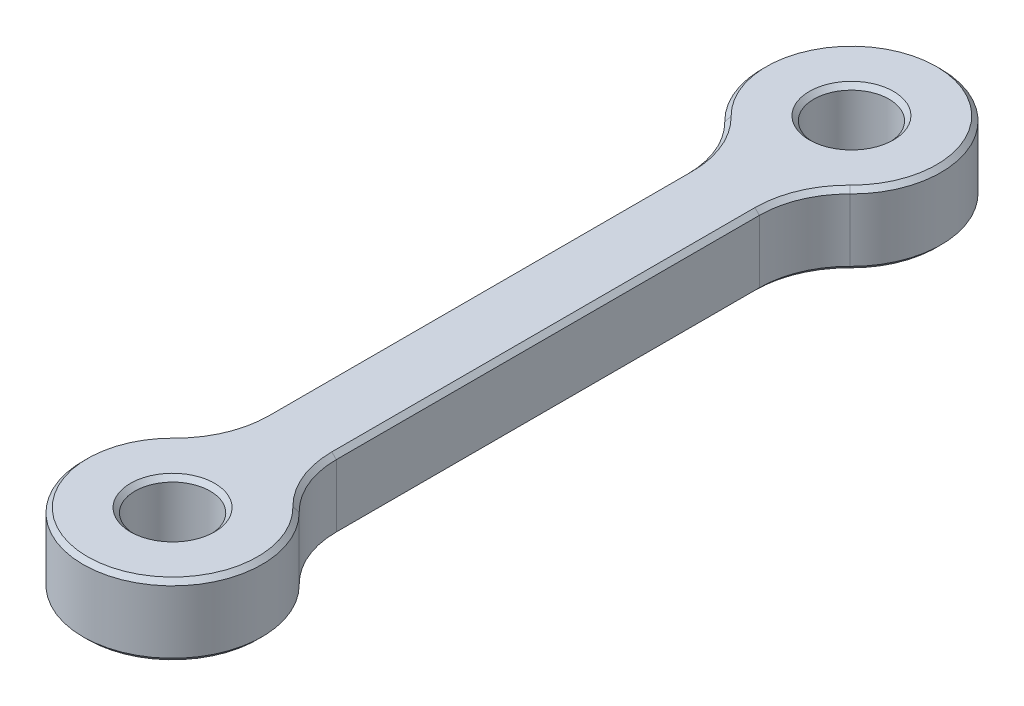
ISO-10303-21;
HEADER;
FILE_DESCRIPTION(('STEP AP214'),'2;1');
FILE_NAME('part.step','',(''),(''),'','','');
FILE_SCHEMA(('AUTOMOTIVE_DESIGN { 1 0 10303 214 1 1 1 1 }'));
ENDSEC;
DATA;
#1=APPLICATION_CONTEXT('core data for automotive mechanical design processes');
#2=APPLICATION_PROTOCOL_DEFINITION('international standard','automotive_design',2000,#1);
#3=PRODUCT_CONTEXT('',#1,'mechanical');
#4=PRODUCT('Part','Part','',(#3));
#5=PRODUCT_RELATED_PRODUCT_CATEGORY('part','',(#4));
#6=PRODUCT_DEFINITION_FORMATION('','',#4);
#7=PRODUCT_DEFINITION_CONTEXT('part definition',#1,'design');
#8=PRODUCT_DEFINITION('design','',#6,#7);
#9=PRODUCT_DEFINITION_SHAPE('','',#8);
#10=(LENGTH_UNIT() NAMED_UNIT(*) SI_UNIT(.MILLI.,.METRE.));
#11=(NAMED_UNIT(*) PLANE_ANGLE_UNIT() SI_UNIT($,.RADIAN.));
#12=(NAMED_UNIT(*) SI_UNIT($,.STERADIAN.) SOLID_ANGLE_UNIT());
#13=UNCERTAINTY_MEASURE_WITH_UNIT(LENGTH_MEASURE(1.E-05),#10,'distance_accuracy_value','');
#14=(GEOMETRIC_REPRESENTATION_CONTEXT(3) GLOBAL_UNCERTAINTY_ASSIGNED_CONTEXT((#13)) GLOBAL_UNIT_ASSIGNED_CONTEXT((#10,
#11,#12)) REPRESENTATION_CONTEXT('',''));
#15=CARTESIAN_POINT('',(0.,0.,0.));
#16=DIRECTION('',(0.,0.,1.));
#17=DIRECTION('',(1.,0.,0.));
#18=AXIS2_PLACEMENT_3D('',#15,#16,#17);
#19=CARTESIAN_POINT('',(0.,8.,-37.9));
#20=DIRECTION('',(0.,1.,0.));
#21=DIRECTION('',(0.,0.,1.));
#22=AXIS2_PLACEMENT_3D('',#19,#20,#21);
#23=PLANE('',#22);
#24=CARTESIAN_POINT('',(0.,8.,37.9));
#25=DIRECTION('',(0.,1.,0.));
#26=DIRECTION('',(0.,0.,1.));
#27=AXIS2_PLACEMENT_3D('',#24,#25,#26);
#28=CIRCLE('',#27,4.70000000000002);
#29=CARTESIAN_POINT('',(0.,8.,42.6));
#30=VERTEX_POINT('',#29);
#31=EDGE_CURVE('E11',#30,#30,#28,.F.);
#32=ORIENTED_EDGE('',*,*,#31,.T.);
#33=EDGE_LOOP('',(#32));
#34=FACE_BOUND('',#33,.T.);
#35=CARTESIAN_POINT('',(0.,8.,37.9));
#36=DIRECTION('',(0.,1.,0.));
#37=DIRECTION('',(0.,0.,1.));
#38=AXIS2_PLACEMENT_3D('',#35,#36,#37);
#39=CIRCLE('',#38,9.49999999999999);
#40=CARTESIAN_POINT('',(-6.64999999999998,8.,31.1156429928843));
#41=VERTEX_POINT('',#40);
#42=CARTESIAN_POINT('',(6.64999999999999,8.,31.1156429928843));
#43=VERTEX_POINT('',#42);
#44=EDGE_CURVE('E58',#41,#43,#39,.T.);
#45=ORIENTED_EDGE('',*,*,#44,.T.);
#46=CARTESIAN_POINT('',(14.,8.,23.6171431429143));
#47=DIRECTION('',(0.,1.,0.));
#48=DIRECTION('',(0.,0.,1.));
#49=AXIS2_PLACEMENT_3D('',#46,#47,#48);
#50=CIRCLE('',#49,10.5);
#51=CARTESIAN_POINT('',(3.49999999999998,8.,23.6171431429143));
#52=VERTEX_POINT('',#51);
#53=EDGE_CURVE('E50',#43,#52,#50,.F.);
#54=ORIENTED_EDGE('',*,*,#53,.T.);
#55=DIRECTION('',(0.,0.,-1.));
#56=VECTOR('',#55,1.);
#57=CARTESIAN_POINT('',(3.49999999999998,8.,-23.6171431429143));
#58=LINE('',#57,#56);
#59=CARTESIAN_POINT('',(3.49999999999998,8.,-23.6171431429143));
#60=VERTEX_POINT('',#59);
#61=EDGE_CURVE('E240',#52,#60,#58,.T.);
#62=ORIENTED_EDGE('',*,*,#61,.T.);
#63=CARTESIAN_POINT('',(14.,8.,-23.6171431429143));
#64=DIRECTION('',(0.,1.,0.));
#65=DIRECTION('',(0.,0.,1.));
#66=AXIS2_PLACEMENT_3D('',#63,#64,#65);
#67=CIRCLE('',#66,10.5);
#68=CARTESIAN_POINT('',(6.64999999999999,8.,-31.1156429928843));
#69=VERTEX_POINT('',#68);
#70=EDGE_CURVE('E242',#60,#69,#67,.F.);
#71=ORIENTED_EDGE('',*,*,#70,.T.);
#72=CARTESIAN_POINT('',(0.,8.,-37.9));
#73=DIRECTION('',(0.,1.,0.));
#74=DIRECTION('',(0.,0.,1.));
#75=AXIS2_PLACEMENT_3D('',#72,#73,#74);
#76=CIRCLE('',#75,9.49999999999999);
#77=CARTESIAN_POINT('',(-6.64999999999998,8.,-31.1156429928843));
#78=VERTEX_POINT('',#77);
#79=EDGE_CURVE('E244',#69,#78,#76,.T.);
#80=ORIENTED_EDGE('',*,*,#79,.T.);
#81=CARTESIAN_POINT('',(-14.,8.,-23.6171431429143));
#82=DIRECTION('',(0.,1.,0.));
#83=DIRECTION('',(0.,0.,1.));
#84=AXIS2_PLACEMENT_3D('',#81,#82,#83);
#85=CIRCLE('',#84,10.5);
#86=CARTESIAN_POINT('',(-3.49999999999998,8.,-23.6171431429143));
#87=VERTEX_POINT('',#86);
#88=EDGE_CURVE('E246',#78,#87,#85,.F.);
#89=ORIENTED_EDGE('',*,*,#88,.T.);
#90=DIRECTION('',(0.,0.,1.));
#91=VECTOR('',#90,1.);
#92=CARTESIAN_POINT('',(-3.49999999999998,8.,23.6171431429143));
#93=LINE('',#92,#91);
#94=CARTESIAN_POINT('',(-3.49999999999998,8.,23.6171431429143));
#95=VERTEX_POINT('',#94);
#96=EDGE_CURVE('E248',#87,#95,#93,.T.);
#97=ORIENTED_EDGE('',*,*,#96,.T.);
#98=CARTESIAN_POINT('',(-14.,8.,23.6171431429143));
#99=DIRECTION('',(0.,1.,0.));
#100=DIRECTION('',(0.,0.,1.));
#101=AXIS2_PLACEMENT_3D('',#98,#99,#100);
#102=CIRCLE('',#101,10.5);
#103=EDGE_CURVE('E63',#95,#41,#102,.F.);
#104=ORIENTED_EDGE('',*,*,#103,.T.);
#105=EDGE_LOOP('',(#45,#54,#62,#71,#80,#89,#97,#104));
#106=FACE_BOUND('',#105,.T.);
#107=CARTESIAN_POINT('',(0.,8.,-37.9));
#108=DIRECTION('',(0.,1.,0.));
#109=DIRECTION('',(0.,0.,1.));
#110=AXIS2_PLACEMENT_3D('',#107,#108,#109);
#111=CIRCLE('',#110,4.70000000000002);
#112=CARTESIAN_POINT('',(0.,8.,-33.2));
#113=VERTEX_POINT('',#112);
#114=EDGE_CURVE('E237',#113,#113,#111,.F.);
#115=ORIENTED_EDGE('',*,*,#114,.T.);
#116=EDGE_LOOP('',(#115));
#117=FACE_BOUND('',#116,.T.);
#118=ADVANCED_FACE('F40',(#34,#106,#117),#23,.T.);
#119=CARTESIAN_POINT('',(0.,0.,-37.9));
#120=DIRECTION('',(0.,1.,0.));
#121=DIRECTION('',(0.,0.,1.));
#122=AXIS2_PLACEMENT_3D('',#119,#120,#121);
#123=PLANE('',#122);
#124=CARTESIAN_POINT('',(0.,0.,37.9));
#125=DIRECTION('',(0.,1.,0.));
#126=DIRECTION('',(0.,0.,1.));
#127=AXIS2_PLACEMENT_3D('',#124,#125,#126);
#128=CIRCLE('',#127,4.70000000000001);
#129=CARTESIAN_POINT('',(0.,0.,42.6));
#130=VERTEX_POINT('',#129);
#131=EDGE_CURVE('E185',#130,#130,#128,.T.);
#132=ORIENTED_EDGE('',*,*,#131,.T.);
#133=EDGE_LOOP('',(#132));
#134=FACE_BOUND('',#133,.T.);
#135=CARTESIAN_POINT('',(0.,0.,-37.9));
#136=DIRECTION('',(0.,1.,0.));
#137=DIRECTION('',(0.,0.,1.));
#138=AXIS2_PLACEMENT_3D('',#135,#136,#137);
#139=CIRCLE('',#138,4.70000000000001);
#140=CARTESIAN_POINT('',(0.,0.,-33.2));
#141=VERTEX_POINT('',#140);
#142=EDGE_CURVE('E182',#141,#141,#139,.T.);
#143=ORIENTED_EDGE('',*,*,#142,.T.);
#144=EDGE_LOOP('',(#143));
#145=FACE_BOUND('',#144,.T.);
#146=DIRECTION('',(0.,0.,-1.));
#147=VECTOR('',#146,1.);
#148=CARTESIAN_POINT('',(-3.49999999999996,0.,-37.9));
#149=LINE('',#148,#147);
#150=CARTESIAN_POINT('',(-3.49999999999997,0.,23.6171431429143));
#151=VERTEX_POINT('',#150);
#152=CARTESIAN_POINT('',(-3.49999999999996,0.,-23.6171431429143));
#153=VERTEX_POINT('',#152);
#154=EDGE_CURVE('E180',#151,#153,#149,.T.);
#155=ORIENTED_EDGE('',*,*,#154,.T.);
#156=CARTESIAN_POINT('',(-14.,0.,-23.6171431429143));
#157=DIRECTION('',(0.,1.,0.));
#158=DIRECTION('',(0.,0.,1.));
#159=AXIS2_PLACEMENT_3D('',#156,#157,#158);
#160=CIRCLE('',#159,10.5);
#161=CARTESIAN_POINT('',(-6.64999999999997,0.,-31.1156429928843));
#162=VERTEX_POINT('',#161);
#163=EDGE_CURVE('E161',#153,#162,#160,.T.);
#164=ORIENTED_EDGE('',*,*,#163,.T.);
#165=CARTESIAN_POINT('',(0.,0.,-37.9));
#166=DIRECTION('',(0.,1.,0.));
#167=DIRECTION('',(0.,0.,1.));
#168=AXIS2_PLACEMENT_3D('',#165,#166,#167);
#169=CIRCLE('',#168,9.49999999999997);
#170=CARTESIAN_POINT('',(6.64999999999998,0.,-31.1156429928843));
#171=VERTEX_POINT('',#170);
#172=EDGE_CURVE('E169',#162,#171,#169,.F.);
#173=ORIENTED_EDGE('',*,*,#172,.T.);
#174=CARTESIAN_POINT('',(14.,0.,-23.6171431429143));
#175=DIRECTION('',(0.,1.,0.));
#176=DIRECTION('',(0.,0.,1.));
#177=AXIS2_PLACEMENT_3D('',#174,#175,#176);
#178=CIRCLE('',#177,10.5);
#179=CARTESIAN_POINT('',(3.49999999999997,0.,-23.6171431429143));
#180=VERTEX_POINT('',#179);
#181=EDGE_CURVE('E175',#171,#180,#178,.T.);
#182=ORIENTED_EDGE('',*,*,#181,.T.);
#183=DIRECTION('',(0.,0.,1.));
#184=VECTOR('',#183,1.);
#185=CARTESIAN_POINT('',(3.49999999999997,0.,-37.9));
#186=LINE('',#185,#184);
#187=CARTESIAN_POINT('',(3.49999999999997,0.,23.6171431429143));
#188=VERTEX_POINT('',#187);
#189=EDGE_CURVE('E328',#180,#188,#186,.T.);
#190=ORIENTED_EDGE('',*,*,#189,.T.);
#191=CARTESIAN_POINT('',(14.,0.,23.6171431429143));
#192=DIRECTION('',(0.,1.,0.));
#193=DIRECTION('',(0.,0.,1.));
#194=AXIS2_PLACEMENT_3D('',#191,#192,#193);
#195=CIRCLE('',#194,10.5);
#196=CARTESIAN_POINT('',(6.64999999999998,0.,31.1156429928843));
#197=VERTEX_POINT('',#196);
#198=EDGE_CURVE('E330',#188,#197,#195,.T.);
#199=ORIENTED_EDGE('',*,*,#198,.T.);
#200=CARTESIAN_POINT('',(0.,0.,37.9));
#201=DIRECTION('',(0.,1.,0.));
#202=DIRECTION('',(0.,0.,1.));
#203=AXIS2_PLACEMENT_3D('',#200,#201,#202);
#204=CIRCLE('',#203,9.49999999999997);
#205=CARTESIAN_POINT('',(-6.64999999999997,0.,31.1156429928843));
#206=VERTEX_POINT('',#205);
#207=EDGE_CURVE('E332',#197,#206,#204,.F.);
#208=ORIENTED_EDGE('',*,*,#207,.T.);
#209=CARTESIAN_POINT('',(-14.,0.,23.6171431429143));
#210=DIRECTION('',(0.,1.,0.));
#211=DIRECTION('',(0.,0.,1.));
#212=AXIS2_PLACEMENT_3D('',#209,#210,#211);
#213=CIRCLE('',#212,10.5);
#214=EDGE_CURVE('E187',#206,#151,#213,.T.);
#215=ORIENTED_EDGE('',*,*,#214,.T.);
#216=EDGE_LOOP('',(#155,#164,#173,#182,#190,#199,#208,#215));
#217=FACE_BOUND('',#216,.T.);
#218=ADVANCED_FACE('F178',(#134,#145,#217),#123,.F.);
#219=CARTESIAN_POINT('',(0.,8.,-37.9));
#220=DIRECTION('',(0.,-1.,0.));
#221=DIRECTION('',(0.,0.,-1.));
#222=AXIS2_PLACEMENT_3D('',#219,#220,#221);
#223=CYLINDRICAL_SURFACE('',#222,10.);
#224=DIRECTION('',(0.,-1.,0.));
#225=VECTOR('',#224,1.);
#226=CARTESIAN_POINT('',(7.,8.,-30.7585715714571));
#227=LINE('',#226,#225);
#228=CARTESIAN_POINT('',(7.,7.49999999999999,-30.7585715714571));
#229=VERTEX_POINT('',#228);
#230=CARTESIAN_POINT('',(7.,0.50000000000002,-30.7585715714571));
#231=VERTEX_POINT('',#230);
#232=EDGE_CURVE('E314',#229,#231,#227,.T.);
#233=ORIENTED_EDGE('',*,*,#232,.T.);
#234=CARTESIAN_POINT('',(0.,0.50000000000002,-37.9));
#235=DIRECTION('',(0.,1.,0.));
#236=DIRECTION('',(0.,0.,1.));
#237=AXIS2_PLACEMENT_3D('',#234,#235,#236);
#238=CIRCLE('',#237,10.);
#239=CARTESIAN_POINT('',(-6.99999999999999,0.50000000000002,-30.7585715714571));
#240=VERTEX_POINT('',#239);
#241=EDGE_CURVE('E235',#231,#240,#238,.T.);
#242=ORIENTED_EDGE('',*,*,#241,.T.);
#243=DIRECTION('',(0.,-1.,0.));
#244=VECTOR('',#243,1.);
#245=CARTESIAN_POINT('',(-6.99999999999999,8.,-30.7585715714571));
#246=LINE('',#245,#244);
#247=CARTESIAN_POINT('',(-6.99999999999999,7.49999999999999,-30.7585715714571));
#248=VERTEX_POINT('',#247);
#249=EDGE_CURVE('E308',#240,#248,#246,.F.);
#250=ORIENTED_EDGE('',*,*,#249,.T.);
#251=CARTESIAN_POINT('',(0.,7.49999999999999,-37.9));
#252=DIRECTION('',(0.,1.,0.));
#253=DIRECTION('',(0.,0.,1.));
#254=AXIS2_PLACEMENT_3D('',#251,#252,#253);
#255=CIRCLE('',#254,10.);
#256=EDGE_CURVE('E233',#248,#229,#255,.F.);
#257=ORIENTED_EDGE('',*,*,#256,.T.);
#258=EDGE_LOOP('',(#233,#242,#250,#257));
#259=FACE_BOUND('',#258,.T.);
#260=ADVANCED_FACE('F312',(#259),#223,.T.);
#261=CARTESIAN_POINT('',(-3.99999999999999,8.,-28.7348486100883));
#262=DIRECTION('',(1.,0.,0.));
#263=DIRECTION('',(0.,0.,-1.));
#264=AXIS2_PLACEMENT_3D('',#261,#262,#263);
#265=PLANE('',#264);
#266=DIRECTION('',(0.,1.,0.));
#267=VECTOR('',#266,1.);
#268=CARTESIAN_POINT('',(-3.99999999999999,0.,-23.6171431429143));
#269=LINE('',#268,#267);
#270=CARTESIAN_POINT('',(-3.99999999999999,7.49999999999999,-23.6171431429143));
#271=VERTEX_POINT('',#270);
#272=CARTESIAN_POINT('',(-3.99999999999999,0.50000000000002,-23.6171431429143));
#273=VERTEX_POINT('',#272);
#274=EDGE_CURVE('E176',#271,#273,#269,.F.);
#275=ORIENTED_EDGE('',*,*,#274,.T.);
#276=DIRECTION('',(0.,0.,1.));
#277=VECTOR('',#276,1.);
#278=CARTESIAN_POINT('',(-3.99999999999999,0.50000000000002,-28.7348486100883));
#279=LINE('',#278,#277);
#280=CARTESIAN_POINT('',(-3.99999999999999,0.50000000000002,23.6171431429143));
#281=VERTEX_POINT('',#280);
#282=EDGE_CURVE('E210',#273,#281,#279,.T.);
#283=ORIENTED_EDGE('',*,*,#282,.T.);
#284=DIRECTION('',(0.,1.,0.));
#285=VECTOR('',#284,1.);
#286=CARTESIAN_POINT('',(-3.99999999999999,8.,23.6171431429143));
#287=LINE('',#286,#285);
#288=CARTESIAN_POINT('',(-3.99999999999999,7.49999999999999,23.6171431429143));
#289=VERTEX_POINT('',#288);
#290=EDGE_CURVE('E317',#281,#289,#287,.T.);
#291=ORIENTED_EDGE('',*,*,#290,.T.);
#292=DIRECTION('',(0.,0.,-1.));
#293=VECTOR('',#292,1.);
#294=CARTESIAN_POINT('',(-3.99999999999999,7.49999999999999,-23.6171431429143));
#295=LINE('',#294,#293);
#296=EDGE_CURVE('E208',#289,#271,#295,.T.);
#297=ORIENTED_EDGE('',*,*,#296,.T.);
#298=EDGE_LOOP('',(#275,#283,#291,#297));
#299=FACE_BOUND('',#298,.T.);
#300=ADVANCED_FACE('F345',(#299),#265,.F.);
#301=CARTESIAN_POINT('',(0.,8.,37.9));
#302=DIRECTION('',(0.,-1.,0.));
#303=DIRECTION('',(0.,0.,-1.));
#304=AXIS2_PLACEMENT_3D('',#301,#302,#303);
#305=CYLINDRICAL_SURFACE('',#304,10.);
#306=DIRECTION('',(0.,-1.,0.));
#307=VECTOR('',#306,1.);
#308=CARTESIAN_POINT('',(-6.99999999999999,8.,30.7585715714571));
#309=LINE('',#308,#307);
#310=CARTESIAN_POINT('',(-6.99999999999999,7.49999999999999,30.7585715714571));
#311=VERTEX_POINT('',#310);
#312=CARTESIAN_POINT('',(-6.99999999999999,0.50000000000002,30.7585715714571));
#313=VERTEX_POINT('',#312);
#314=EDGE_CURVE('E320',#311,#313,#309,.T.);
#315=ORIENTED_EDGE('',*,*,#314,.T.);
#316=CARTESIAN_POINT('',(0.,0.50000000000002,37.9));
#317=DIRECTION('',(0.,1.,0.));
#318=DIRECTION('',(0.,0.,1.));
#319=AXIS2_PLACEMENT_3D('',#316,#317,#318);
#320=CIRCLE('',#319,10.);
#321=CARTESIAN_POINT('',(7.,0.50000000000002,30.7585715714571));
#322=VERTEX_POINT('',#321);
#323=EDGE_CURVE('E218',#313,#322,#320,.T.);
#324=ORIENTED_EDGE('',*,*,#323,.T.);
#325=DIRECTION('',(0.,-1.,0.));
#326=VECTOR('',#325,1.);
#327=CARTESIAN_POINT('',(7.,8.,30.7585715714571));
#328=LINE('',#327,#326);
#329=CARTESIAN_POINT('',(7.,7.49999999999999,30.7585715714571));
#330=VERTEX_POINT('',#329);
#331=EDGE_CURVE('E315',#322,#330,#328,.F.);
#332=ORIENTED_EDGE('',*,*,#331,.T.);
#333=CARTESIAN_POINT('',(0.,7.49999999999999,37.9));
#334=DIRECTION('',(0.,1.,0.));
#335=DIRECTION('',(0.,0.,1.));
#336=AXIS2_PLACEMENT_3D('',#333,#334,#335);
#337=CIRCLE('',#336,10.);
#338=EDGE_CURVE('E216',#330,#311,#337,.F.);
#339=ORIENTED_EDGE('',*,*,#338,.T.);
#340=EDGE_LOOP('',(#315,#324,#332,#339));
#341=FACE_BOUND('',#340,.T.);
#342=ADVANCED_FACE('F388',(#341),#305,.T.);
#343=CARTESIAN_POINT('',(3.99999999999999,8.,28.7348486100883));
#344=DIRECTION('',(-1.,0.,0.));
#345=DIRECTION('',(0.,0.,1.));
#346=AXIS2_PLACEMENT_3D('',#343,#344,#345);
#347=PLANE('',#346);
#348=DIRECTION('',(0.,1.,0.));
#349=VECTOR('',#348,1.);
#350=CARTESIAN_POINT('',(3.99999999999999,0.,23.6171431429143));
#351=LINE('',#350,#349);
#352=CARTESIAN_POINT('',(3.99999999999999,7.49999999999999,23.6171431429143));
#353=VERTEX_POINT('',#352);
#354=CARTESIAN_POINT('',(3.99999999999999,0.50000000000002,23.6171431429143));
#355=VERTEX_POINT('',#354);
#356=EDGE_CURVE('E377',#353,#355,#351,.F.);
#357=ORIENTED_EDGE('',*,*,#356,.T.);
#358=DIRECTION('',(0.,0.,-1.));
#359=VECTOR('',#358,1.);
#360=CARTESIAN_POINT('',(3.99999999999999,0.50000000000002,28.7348486100883));
#361=LINE('',#360,#359);
#362=CARTESIAN_POINT('',(3.99999999999999,0.50000000000002,-23.6171431429143));
#363=VERTEX_POINT('',#362);
#364=EDGE_CURVE('E227',#355,#363,#361,.T.);
#365=ORIENTED_EDGE('',*,*,#364,.T.);
#366=DIRECTION('',(0.,1.,0.));
#367=VECTOR('',#366,1.);
#368=CARTESIAN_POINT('',(3.99999999999999,8.,-23.6171431429143));
#369=LINE('',#368,#367);
#370=CARTESIAN_POINT('',(3.99999999999999,7.49999999999999,-23.6171431429143));
#371=VERTEX_POINT('',#370);
#372=EDGE_CURVE('E270',#363,#371,#369,.T.);
#373=ORIENTED_EDGE('',*,*,#372,.T.);
#374=DIRECTION('',(0.,0.,1.));
#375=VECTOR('',#374,1.);
#376=CARTESIAN_POINT('',(3.99999999999999,7.49999999999999,23.6171431429143));
#377=LINE('',#376,#375);
#378=EDGE_CURVE('E225',#371,#353,#377,.T.);
#379=ORIENTED_EDGE('',*,*,#378,.T.);
#380=EDGE_LOOP('',(#357,#365,#373,#379));
#381=FACE_BOUND('',#380,.T.);
#382=ADVANCED_FACE('F376',(#381),#347,.F.);
#383=CARTESIAN_POINT('',(0.,8.,-37.9));
#384=DIRECTION('',(0.,-1.,0.));
#385=DIRECTION('',(0.,0.,-1.));
#386=AXIS2_PLACEMENT_3D('',#383,#384,#385);
#387=CYLINDRICAL_SURFACE('',#386,4.2);
#388=CARTESIAN_POINT('',(0.,0.499999999999993,-37.9));
#389=DIRECTION('',(0.,1.,0.));
#390=DIRECTION('',(0.,0.,1.));
#391=AXIS2_PLACEMENT_3D('',#388,#389,#390);
#392=CIRCLE('',#391,4.2);
#393=CARTESIAN_POINT('',(0.,0.499999999999993,-33.7));
#394=VERTEX_POINT('',#393);
#395=EDGE_CURVE('E202',#394,#394,#392,.F.);
#396=ORIENTED_EDGE('',*,*,#395,.T.);
#397=EDGE_LOOP('',(#396));
#398=FACE_BOUND('',#397,.T.);
#399=CARTESIAN_POINT('',(0.,7.49999999999998,-37.9));
#400=DIRECTION('',(0.,1.,0.));
#401=DIRECTION('',(0.,0.,1.));
#402=AXIS2_PLACEMENT_3D('',#399,#400,#401);
#403=CIRCLE('',#402,4.2);
#404=CARTESIAN_POINT('',(0.,7.49999999999998,-33.7));
#405=VERTEX_POINT('',#404);
#406=EDGE_CURVE('E199',#405,#405,#403,.T.);
#407=ORIENTED_EDGE('',*,*,#406,.T.);
#408=EDGE_LOOP('',(#407));
#409=FACE_BOUND('',#408,.T.);
#410=ADVANCED_FACE('F422',(#398,#409),#387,.F.);
#411=CARTESIAN_POINT('',(0.,8.,37.9));
#412=DIRECTION('',(0.,-1.,0.));
#413=DIRECTION('',(0.,0.,-1.));
#414=AXIS2_PLACEMENT_3D('',#411,#412,#413);
#415=CYLINDRICAL_SURFACE('',#414,4.2);
#416=CARTESIAN_POINT('',(0.,0.499999999999993,37.9));
#417=DIRECTION('',(0.,1.,0.));
#418=DIRECTION('',(0.,0.,1.));
#419=AXIS2_PLACEMENT_3D('',#416,#417,#418);
#420=CIRCLE('',#419,4.2);
#421=CARTESIAN_POINT('',(0.,0.499999999999993,42.1));
#422=VERTEX_POINT('',#421);
#423=EDGE_CURVE('E196',#422,#422,#420,.F.);
#424=ORIENTED_EDGE('',*,*,#423,.T.);
#425=EDGE_LOOP('',(#424));
#426=FACE_BOUND('',#425,.T.);
#427=CARTESIAN_POINT('',(0.,7.49999999999998,37.9));
#428=DIRECTION('',(0.,1.,0.));
#429=DIRECTION('',(0.,0.,1.));
#430=AXIS2_PLACEMENT_3D('',#427,#428,#429);
#431=CIRCLE('',#430,4.2);
#432=CARTESIAN_POINT('',(0.,7.49999999999998,42.1));
#433=VERTEX_POINT('',#432);
#434=EDGE_CURVE('E193',#433,#433,#431,.T.);
#435=ORIENTED_EDGE('',*,*,#434,.T.);
#436=EDGE_LOOP('',(#435));
#437=FACE_BOUND('',#436,.T.);
#438=ADVANCED_FACE('F435',(#426,#437),#415,.F.);
#439=CARTESIAN_POINT('',(14.,8.,23.6171431429143));
#440=DIRECTION('',(0.,-1.,0.));
#441=DIRECTION('',(0.,0.,-1.));
#442=AXIS2_PLACEMENT_3D('',#439,#440,#441);
#443=CYLINDRICAL_SURFACE('',#442,10.);
#444=ORIENTED_EDGE('',*,*,#331,.F.);
#445=CARTESIAN_POINT('',(14.,0.50000000000002,23.6171431429143));
#446=DIRECTION('',(0.,1.,0.));
#447=DIRECTION('',(0.,0.,1.));
#448=AXIS2_PLACEMENT_3D('',#445,#446,#447);
#449=CIRCLE('',#448,10.);
#450=EDGE_CURVE('E223',#322,#355,#449,.F.);
#451=ORIENTED_EDGE('',*,*,#450,.T.);
#452=ORIENTED_EDGE('',*,*,#356,.F.);
#453=CARTESIAN_POINT('',(14.,7.49999999999999,23.6171431429143));
#454=DIRECTION('',(0.,1.,0.));
#455=DIRECTION('',(0.,0.,1.));
#456=AXIS2_PLACEMENT_3D('',#453,#454,#455);
#457=CIRCLE('',#456,10.);
#458=EDGE_CURVE('E220',#353,#330,#457,.T.);
#459=ORIENTED_EDGE('',*,*,#458,.T.);
#460=EDGE_LOOP('',(#444,#451,#452,#459));
#461=FACE_BOUND('',#460,.T.);
#462=ADVANCED_FACE('F382',(#461),#443,.F.);
#463=CARTESIAN_POINT('',(14.,8.,-23.6171431429143));
#464=DIRECTION('',(0.,-1.,0.));
#465=DIRECTION('',(0.,0.,-1.));
#466=AXIS2_PLACEMENT_3D('',#463,#464,#465);
#467=CYLINDRICAL_SURFACE('',#466,10.);
#468=ORIENTED_EDGE('',*,*,#372,.F.);
#469=CARTESIAN_POINT('',(14.,0.50000000000002,-23.6171431429143));
#470=DIRECTION('',(0.,1.,0.));
#471=DIRECTION('',(0.,0.,1.));
#472=AXIS2_PLACEMENT_3D('',#469,#470,#471);
#473=CIRCLE('',#472,10.);
#474=EDGE_CURVE('E231',#363,#231,#473,.F.);
#475=ORIENTED_EDGE('',*,*,#474,.T.);
#476=ORIENTED_EDGE('',*,*,#232,.F.);
#477=CARTESIAN_POINT('',(14.,7.49999999999999,-23.6171431429143));
#478=DIRECTION('',(0.,1.,0.));
#479=DIRECTION('',(0.,0.,1.));
#480=AXIS2_PLACEMENT_3D('',#477,#478,#479);
#481=CIRCLE('',#480,10.);
#482=EDGE_CURVE('E229',#229,#371,#481,.T.);
#483=ORIENTED_EDGE('',*,*,#482,.T.);
#484=EDGE_LOOP('',(#468,#475,#476,#483));
#485=FACE_BOUND('',#484,.T.);
#486=ADVANCED_FACE('F402',(#485),#467,.F.);
#487=CARTESIAN_POINT('',(-14.,8.,-23.6171431429143));
#488=DIRECTION('',(0.,-1.,0.));
#489=DIRECTION('',(0.,0.,-1.));
#490=AXIS2_PLACEMENT_3D('',#487,#488,#489);
#491=CYLINDRICAL_SURFACE('',#490,10.);
#492=ORIENTED_EDGE('',*,*,#249,.F.);
#493=CARTESIAN_POINT('',(-14.,0.50000000000002,-23.6171431429143));
#494=DIRECTION('',(0.,1.,0.));
#495=DIRECTION('',(0.,0.,1.));
#496=AXIS2_PLACEMENT_3D('',#493,#494,#495);
#497=CIRCLE('',#496,10.);
#498=EDGE_CURVE('E163',#240,#273,#497,.F.);
#499=ORIENTED_EDGE('',*,*,#498,.T.);
#500=ORIENTED_EDGE('',*,*,#274,.F.);
#501=CARTESIAN_POINT('',(-14.,7.49999999999999,-23.6171431429143));
#502=DIRECTION('',(0.,1.,0.));
#503=DIRECTION('',(0.,0.,1.));
#504=AXIS2_PLACEMENT_3D('',#501,#502,#503);
#505=CIRCLE('',#504,10.);
#506=EDGE_CURVE('E205',#271,#248,#505,.T.);
#507=ORIENTED_EDGE('',*,*,#506,.T.);
#508=EDGE_LOOP('',(#492,#499,#500,#507));
#509=FACE_BOUND('',#508,.T.);
#510=ADVANCED_FACE('F307',(#509),#491,.F.);
#511=CARTESIAN_POINT('',(-14.,8.,23.6171431429143));
#512=DIRECTION('',(0.,-1.,0.));
#513=DIRECTION('',(0.,0.,-1.));
#514=AXIS2_PLACEMENT_3D('',#511,#512,#513);
#515=CYLINDRICAL_SURFACE('',#514,10.);
#516=ORIENTED_EDGE('',*,*,#290,.F.);
#517=CARTESIAN_POINT('',(-14.,0.50000000000002,23.6171431429143));
#518=DIRECTION('',(0.,1.,0.));
#519=DIRECTION('',(0.,0.,1.));
#520=AXIS2_PLACEMENT_3D('',#517,#518,#519);
#521=CIRCLE('',#520,10.);
#522=EDGE_CURVE('E214',#281,#313,#521,.F.);
#523=ORIENTED_EDGE('',*,*,#522,.T.);
#524=ORIENTED_EDGE('',*,*,#314,.F.);
#525=CARTESIAN_POINT('',(-14.,7.49999999999999,23.6171431429143));
#526=DIRECTION('',(0.,1.,0.));
#527=DIRECTION('',(0.,0.,1.));
#528=AXIS2_PLACEMENT_3D('',#525,#526,#527);
#529=CIRCLE('',#528,10.);
#530=EDGE_CURVE('E212',#311,#289,#529,.T.);
#531=ORIENTED_EDGE('',*,*,#530,.T.);
#532=EDGE_LOOP('',(#516,#523,#524,#531));
#533=FACE_BOUND('',#532,.T.);
#534=ADVANCED_FACE('F347',(#533),#515,.F.);
#535=CARTESIAN_POINT('',(0.,0.,37.9));
#536=DIRECTION('',(0.,-1.,0.));
#537=DIRECTION('',(0.,0.,-1.));
#538=AXIS2_PLACEMENT_3D('',#535,#536,#537);
#539=CONICAL_SURFACE('',#538,4.70000000000001,0.785398163397461);
#540=ORIENTED_EDGE('',*,*,#423,.F.);
#541=EDGE_LOOP('',(#540));
#542=FACE_BOUND('',#541,.T.);
#543=ORIENTED_EDGE('',*,*,#131,.F.);
#544=EDGE_LOOP('',(#543));
#545=FACE_BOUND('',#544,.T.);
#546=ADVANCED_FACE('F442',(#542,#545),#539,.F.);
#547=CARTESIAN_POINT('',(0.,0.,-37.9));
#548=DIRECTION('',(0.,-1.,0.));
#549=DIRECTION('',(0.,0.,-1.));
#550=AXIS2_PLACEMENT_3D('',#547,#548,#549);
#551=CONICAL_SURFACE('',#550,4.70000000000001,0.785398163397461);
#552=ORIENTED_EDGE('',*,*,#395,.F.);
#553=EDGE_LOOP('',(#552));
#554=FACE_BOUND('',#553,.T.);
#555=ORIENTED_EDGE('',*,*,#142,.F.);
#556=EDGE_LOOP('',(#555));
#557=FACE_BOUND('',#556,.T.);
#558=ADVANCED_FACE('F449',(#554,#557),#551,.F.);
#559=CARTESIAN_POINT('',(14.,0.,23.6171431429143));
#560=DIRECTION('',(0.,-1.,0.));
#561=DIRECTION('',(0.,0.,-1.));
#562=AXIS2_PLACEMENT_3D('',#559,#560,#561);
#563=CONICAL_SURFACE('',#562,10.5,0.785398163397457);
#564=DIRECTION('',(-0.707106781186554,-0.707106781186541,0.));
#565=VECTOR('',#564,1.);
#566=CARTESIAN_POINT('',(3.99999999999999,0.50000000000002,23.6171431429143));
#567=LINE('',#566,#565);
#568=EDGE_CURVE('E264',#355,#188,#567,.T.);
#569=ORIENTED_EDGE('',*,*,#568,.F.);
#570=ORIENTED_EDGE('',*,*,#450,.F.);
#571=DIRECTION('',(0.494974746830587,0.707106781186541,-0.50497524691811));
#572=VECTOR('',#571,1.);
#573=CARTESIAN_POINT('',(6.64999999999998,0.,31.1156429928843));
#574=LINE('',#573,#572);
#575=EDGE_CURVE('E267',#197,#322,#574,.T.);
#576=ORIENTED_EDGE('',*,*,#575,.F.);
#577=ORIENTED_EDGE('',*,*,#198,.F.);
#578=EDGE_LOOP('',(#569,#570,#576,#577));
#579=FACE_BOUND('',#578,.T.);
#580=ADVANCED_FACE('F394',(#579),#563,.F.);
#581=CARTESIAN_POINT('',(0.,0.50000000000002,37.9));
#582=DIRECTION('',(0.,1.,0.));
#583=DIRECTION('',(0.,0.,1.));
#584=AXIS2_PLACEMENT_3D('',#581,#582,#583);
#585=CONICAL_SURFACE('',#584,10.,0.785398163397457);
#586=ORIENTED_EDGE('',*,*,#575,.T.);
#587=ORIENTED_EDGE('',*,*,#323,.F.);
#588=DIRECTION('',(-0.494974746830589,0.707106781186542,-0.504975246918106));
#589=VECTOR('',#588,1.);
#590=CARTESIAN_POINT('',(-6.64999999999997,0.,31.1156429928843));
#591=LINE('',#590,#589);
#592=EDGE_CURVE('E261',#206,#313,#591,.T.);
#593=ORIENTED_EDGE('',*,*,#592,.F.);
#594=ORIENTED_EDGE('',*,*,#207,.F.);
#595=EDGE_LOOP('',(#586,#587,#593,#594));
#596=FACE_BOUND('',#595,.T.);
#597=ADVANCED_FACE('F390',(#596),#585,.T.);
#598=CARTESIAN_POINT('',(3.99999999999999,0.50000000000002,28.7348486100883));
#599=DIRECTION('',(-0.707106781186541,0.707106781186554,0.));
#600=DIRECTION('',(0.,0.,-1.));
#601=AXIS2_PLACEMENT_3D('',#598,#599,#600);
#602=PLANE('',#601);
#603=ORIENTED_EDGE('',*,*,#568,.T.);
#604=ORIENTED_EDGE('',*,*,#189,.F.);
#605=DIRECTION('',(-0.707106781186554,-0.707106781186541,0.));
#606=VECTOR('',#605,1.);
#607=CARTESIAN_POINT('',(3.99999999999999,0.50000000000002,-23.6171431429143));
#608=LINE('',#607,#606);
#609=EDGE_CURVE('E258',#363,#180,#608,.T.);
#610=ORIENTED_EDGE('',*,*,#609,.F.);
#611=ORIENTED_EDGE('',*,*,#364,.F.);
#612=EDGE_LOOP('',(#603,#604,#610,#611));
#613=FACE_BOUND('',#612,.T.);
#614=ADVANCED_FACE('F399',(#613),#602,.F.);
#615=CARTESIAN_POINT('',(-14.,0.,23.6171431429143));
#616=DIRECTION('',(0.,-1.,0.));
#617=DIRECTION('',(0.,0.,-1.));
#618=AXIS2_PLACEMENT_3D('',#615,#616,#617);
#619=CONICAL_SURFACE('',#618,10.5,0.785398163397457);
#620=ORIENTED_EDGE('',*,*,#592,.T.);
#621=ORIENTED_EDGE('',*,*,#522,.F.);
#622=DIRECTION('',(-0.707106781186552,0.707106781186543,0.));
#623=VECTOR('',#622,1.);
#624=CARTESIAN_POINT('',(-3.49999999999997,0.,23.6171431429143));
#625=LINE('',#624,#623);
#626=EDGE_CURVE('E255',#151,#281,#625,.T.);
#627=ORIENTED_EDGE('',*,*,#626,.F.);
#628=ORIENTED_EDGE('',*,*,#214,.F.);
#629=EDGE_LOOP('',(#620,#621,#627,#628));
#630=FACE_BOUND('',#629,.T.);
#631=ADVANCED_FACE('F339',(#630),#619,.F.);
#632=CARTESIAN_POINT('',(14.,0.,-23.6171431429143));
#633=DIRECTION('',(0.,-1.,0.));
#634=DIRECTION('',(0.,0.,-1.));
#635=AXIS2_PLACEMENT_3D('',#632,#633,#634);
#636=CONICAL_SURFACE('',#635,10.5,0.785398163397457);
#637=ORIENTED_EDGE('',*,*,#609,.T.);
#638=ORIENTED_EDGE('',*,*,#181,.F.);
#639=DIRECTION('',(-0.494974746830587,-0.707106781186541,-0.50497524691811));
#640=VECTOR('',#639,1.);
#641=CARTESIAN_POINT('',(7.,0.50000000000002,-30.7585715714571));
#642=LINE('',#641,#640);
#643=EDGE_CURVE('E172',#231,#171,#642,.T.);
#644=ORIENTED_EDGE('',*,*,#643,.F.);
#645=ORIENTED_EDGE('',*,*,#474,.F.);
#646=EDGE_LOOP('',(#637,#638,#644,#645));
#647=FACE_BOUND('',#646,.T.);
#648=ADVANCED_FACE('F475',(#647),#636,.F.);
#649=CARTESIAN_POINT('',(-3.99999999999999,0.50000000000002,-28.7348486100883));
#650=DIRECTION('',(0.707106781186541,0.707106781186554,0.));
#651=DIRECTION('',(0.,0.,1.));
#652=AXIS2_PLACEMENT_3D('',#649,#650,#651);
#653=PLANE('',#652);
#654=ORIENTED_EDGE('',*,*,#626,.T.);
#655=ORIENTED_EDGE('',*,*,#282,.F.);
#656=DIRECTION('',(-0.707106781186554,0.707106781186541,0.));
#657=VECTOR('',#656,1.);
#658=CARTESIAN_POINT('',(-3.49999999999996,0.,-23.6171431429143));
#659=LINE('',#658,#657);
#660=EDGE_CURVE('E166',#153,#273,#659,.T.);
#661=ORIENTED_EDGE('',*,*,#660,.F.);
#662=ORIENTED_EDGE('',*,*,#154,.F.);
#663=EDGE_LOOP('',(#654,#655,#661,#662));
#664=FACE_BOUND('',#663,.T.);
#665=ADVANCED_FACE('F342',(#664),#653,.F.);
#666=CARTESIAN_POINT('',(0.,0.50000000000002,-37.9));
#667=DIRECTION('',(0.,1.,0.));
#668=DIRECTION('',(0.,0.,1.));
#669=AXIS2_PLACEMENT_3D('',#666,#667,#668);
#670=CONICAL_SURFACE('',#669,10.,0.785398163397457);
#671=ORIENTED_EDGE('',*,*,#643,.T.);
#672=ORIENTED_EDGE('',*,*,#172,.F.);
#673=DIRECTION('',(0.494974746830589,-0.707106781186542,-0.504975246918106));
#674=VECTOR('',#673,1.);
#675=CARTESIAN_POINT('',(-6.99999999999999,0.50000000000002,-30.7585715714571));
#676=LINE('',#675,#674);
#677=EDGE_CURVE('E157',#240,#162,#676,.T.);
#678=ORIENTED_EDGE('',*,*,#677,.F.);
#679=ORIENTED_EDGE('',*,*,#241,.F.);
#680=EDGE_LOOP('',(#671,#672,#678,#679));
#681=FACE_BOUND('',#680,.T.);
#682=ADVANCED_FACE('F170',(#681),#670,.T.);
#683=CARTESIAN_POINT('',(-14.,0.,-23.6171431429143));
#684=DIRECTION('',(0.,-1.,0.));
#685=DIRECTION('',(0.,0.,-1.));
#686=AXIS2_PLACEMENT_3D('',#683,#684,#685);
#687=CONICAL_SURFACE('',#686,10.5,0.785398163397457);
#688=ORIENTED_EDGE('',*,*,#660,.T.);
#689=ORIENTED_EDGE('',*,*,#498,.F.);
#690=ORIENTED_EDGE('',*,*,#677,.T.);
#691=ORIENTED_EDGE('',*,*,#163,.F.);
#692=EDGE_LOOP('',(#688,#689,#690,#691));
#693=FACE_BOUND('',#692,.T.);
#694=ADVANCED_FACE('F159',(#693),#687,.F.);
#695=CARTESIAN_POINT('',(0.,7.49999999999998,37.9));
#696=DIRECTION('',(0.,1.,0.));
#697=DIRECTION('',(0.,0.,1.));
#698=AXIS2_PLACEMENT_3D('',#695,#696,#697);
#699=CONICAL_SURFACE('',#698,4.2,0.785398163397447);
#700=ORIENTED_EDGE('',*,*,#31,.F.);
#701=EDGE_LOOP('',(#700));
#702=FACE_BOUND('',#701,.T.);
#703=ORIENTED_EDGE('',*,*,#434,.F.);
#704=EDGE_LOOP('',(#703));
#705=FACE_BOUND('',#704,.T.);
#706=ADVANCED_FACE('F464',(#702,#705),#699,.F.);
#707=CARTESIAN_POINT('',(-14.,8.,-23.6171431429143));
#708=DIRECTION('',(0.,1.,0.));
#709=DIRECTION('',(0.,0.,1.));
#710=AXIS2_PLACEMENT_3D('',#707,#708,#709);
#711=CONICAL_SURFACE('',#710,10.5,0.785398163397448);
#712=DIRECTION('',(0.494974746830583,0.707106781186547,-0.504975246918105));
#713=VECTOR('',#712,1.);
#714=CARTESIAN_POINT('',(-6.99999999999999,7.49999999999999,-30.7585715714571));
#715=LINE('',#714,#713);
#716=EDGE_CURVE('E286',#248,#78,#715,.T.);
#717=ORIENTED_EDGE('',*,*,#716,.F.);
#718=ORIENTED_EDGE('',*,*,#506,.F.);
#719=DIRECTION('',(-0.707106781186548,-0.707106781186548,0.));
#720=VECTOR('',#719,1.);
#721=CARTESIAN_POINT('',(-3.49999999999998,8.,-23.6171431429143));
#722=LINE('',#721,#720);
#723=EDGE_CURVE('E45',#87,#271,#722,.T.);
#724=ORIENTED_EDGE('',*,*,#723,.F.);
#725=ORIENTED_EDGE('',*,*,#88,.F.);
#726=EDGE_LOOP('',(#717,#718,#724,#725));
#727=FACE_BOUND('',#726,.T.);
#728=ADVANCED_FACE('F302',(#727),#711,.F.);
#729=CARTESIAN_POINT('',(-3.49999999999998,8.,-37.9));
#730=DIRECTION('',(-0.707106781186548,0.707106781186548,0.));
#731=DIRECTION('',(0.,0.,-1.));
#732=AXIS2_PLACEMENT_3D('',#729,#730,#731);
#733=PLANE('',#732);
#734=ORIENTED_EDGE('',*,*,#723,.T.);
#735=ORIENTED_EDGE('',*,*,#296,.F.);
#736=DIRECTION('',(-0.707106781186548,-0.707106781186548,0.));
#737=VECTOR('',#736,1.);
#738=CARTESIAN_POINT('',(-3.49999999999998,8.,23.6171431429143));
#739=LINE('',#738,#737);
#740=EDGE_CURVE('E284',#95,#289,#739,.T.);
#741=ORIENTED_EDGE('',*,*,#740,.F.);
#742=ORIENTED_EDGE('',*,*,#96,.F.);
#743=EDGE_LOOP('',(#734,#735,#741,#742));
#744=FACE_BOUND('',#743,.T.);
#745=ADVANCED_FACE('F297',(#744),#733,.T.);
#746=CARTESIAN_POINT('',(0.,8.,-37.9));
#747=DIRECTION('',(0.,-1.,0.));
#748=DIRECTION('',(0.,0.,-1.));
#749=AXIS2_PLACEMENT_3D('',#746,#747,#748);
#750=CONICAL_SURFACE('',#749,9.49999999999999,0.785398163397448);
#751=ORIENTED_EDGE('',*,*,#716,.T.);
#752=ORIENTED_EDGE('',*,*,#79,.F.);
#753=DIRECTION('',(-0.494974746830582,0.707106781186547,-0.504975246918106));
#754=VECTOR('',#753,1.);
#755=CARTESIAN_POINT('',(7.,7.49999999999999,-30.7585715714571));
#756=LINE('',#755,#754);
#757=EDGE_CURVE('E281',#229,#69,#756,.T.);
#758=ORIENTED_EDGE('',*,*,#757,.F.);
#759=ORIENTED_EDGE('',*,*,#256,.F.);
#760=EDGE_LOOP('',(#751,#752,#758,#759));
#761=FACE_BOUND('',#760,.T.);
#762=ADVANCED_FACE('F403',(#761),#750,.T.);
#763=CARTESIAN_POINT('',(-14.,8.,23.6171431429143));
#764=DIRECTION('',(0.,1.,0.));
#765=DIRECTION('',(0.,0.,1.));
#766=AXIS2_PLACEMENT_3D('',#763,#764,#765);
#767=CONICAL_SURFACE('',#766,10.5,0.785398163397448);
#768=ORIENTED_EDGE('',*,*,#740,.T.);
#769=ORIENTED_EDGE('',*,*,#530,.F.);
#770=DIRECTION('',(-0.494974746830583,-0.707106781186547,-0.504975246918105));
#771=VECTOR('',#770,1.);
#772=CARTESIAN_POINT('',(-6.64999999999998,8.,31.1156429928843));
#773=LINE('',#772,#771);
#774=EDGE_CURVE('E278',#41,#311,#773,.T.);
#775=ORIENTED_EDGE('',*,*,#774,.F.);
#776=ORIENTED_EDGE('',*,*,#103,.F.);
#777=EDGE_LOOP('',(#768,#769,#775,#776));
#778=FACE_BOUND('',#777,.T.);
#779=ADVANCED_FACE('F352',(#778),#767,.F.);
#780=CARTESIAN_POINT('',(14.,8.,-23.6171431429143));
#781=DIRECTION('',(0.,1.,0.));
#782=DIRECTION('',(0.,0.,1.));
#783=AXIS2_PLACEMENT_3D('',#780,#781,#782);
#784=CONICAL_SURFACE('',#783,10.5,0.785398163397448);
#785=ORIENTED_EDGE('',*,*,#757,.T.);
#786=ORIENTED_EDGE('',*,*,#70,.F.);
#787=DIRECTION('',(-0.707106781186548,0.707106781186548,0.));
#788=VECTOR('',#787,1.);
#789=CARTESIAN_POINT('',(3.99999999999999,7.49999999999999,-23.6171431429143));
#790=LINE('',#789,#788);
#791=EDGE_CURVE('E275',#371,#60,#790,.T.);
#792=ORIENTED_EDGE('',*,*,#791,.F.);
#793=ORIENTED_EDGE('',*,*,#482,.F.);
#794=EDGE_LOOP('',(#785,#786,#792,#793));
#795=FACE_BOUND('',#794,.T.);
#796=ADVANCED_FACE('F367',(#795),#784,.F.);
#797=CARTESIAN_POINT('',(0.,8.,37.9));
#798=DIRECTION('',(0.,-1.,0.));
#799=DIRECTION('',(0.,0.,-1.));
#800=AXIS2_PLACEMENT_3D('',#797,#798,#799);
#801=CONICAL_SURFACE('',#800,9.49999999999999,0.785398163397448);
#802=ORIENTED_EDGE('',*,*,#774,.T.);
#803=ORIENTED_EDGE('',*,*,#338,.F.);
#804=DIRECTION('',(0.494974746830583,-0.707106781186547,-0.504975246918105));
#805=VECTOR('',#804,1.);
#806=CARTESIAN_POINT('',(6.64999999999999,8.,31.1156429928843));
#807=LINE('',#806,#805);
#808=EDGE_CURVE('E273',#43,#330,#807,.T.);
#809=ORIENTED_EDGE('',*,*,#808,.F.);
#810=ORIENTED_EDGE('',*,*,#44,.F.);
#811=EDGE_LOOP('',(#802,#803,#809,#810));
#812=FACE_BOUND('',#811,.T.);
#813=ADVANCED_FACE('F355',(#812),#801,.T.);
#814=CARTESIAN_POINT('',(3.49999999999998,8.,-37.9));
#815=DIRECTION('',(0.707106781186548,0.707106781186548,0.));
#816=DIRECTION('',(0.,0.,1.));
#817=AXIS2_PLACEMENT_3D('',#814,#815,#816);
#818=PLANE('',#817);
#819=ORIENTED_EDGE('',*,*,#791,.T.);
#820=ORIENTED_EDGE('',*,*,#61,.F.);
#821=DIRECTION('',(-0.707106781186548,0.707106781186548,0.));
#822=VECTOR('',#821,1.);
#823=CARTESIAN_POINT('',(3.99999999999999,7.49999999999999,23.6171431429143));
#824=LINE('',#823,#822);
#825=EDGE_CURVE('E271',#353,#52,#824,.T.);
#826=ORIENTED_EDGE('',*,*,#825,.F.);
#827=ORIENTED_EDGE('',*,*,#378,.F.);
#828=EDGE_LOOP('',(#819,#820,#826,#827));
#829=FACE_BOUND('',#828,.T.);
#830=ADVANCED_FACE('F371',(#829),#818,.T.);
#831=CARTESIAN_POINT('',(14.,8.,23.6171431429143));
#832=DIRECTION('',(0.,1.,0.));
#833=DIRECTION('',(0.,0.,1.));
#834=AXIS2_PLACEMENT_3D('',#831,#832,#833);
#835=CONICAL_SURFACE('',#834,10.5,0.785398163397448);
#836=ORIENTED_EDGE('',*,*,#808,.T.);
#837=ORIENTED_EDGE('',*,*,#458,.F.);
#838=ORIENTED_EDGE('',*,*,#825,.T.);
#839=ORIENTED_EDGE('',*,*,#53,.F.);
#840=EDGE_LOOP('',(#836,#837,#838,#839));
#841=FACE_BOUND('',#840,.T.);
#842=ADVANCED_FACE('F359',(#841),#835,.F.);
#843=CARTESIAN_POINT('',(0.,7.49999999999998,-37.9));
#844=DIRECTION('',(0.,1.,0.));
#845=DIRECTION('',(0.,0.,1.));
#846=AXIS2_PLACEMENT_3D('',#843,#844,#845);
#847=CONICAL_SURFACE('',#846,4.2,0.785398163397447);
#848=ORIENTED_EDGE('',*,*,#114,.F.);
#849=EDGE_LOOP('',(#848));
#850=FACE_BOUND('',#849,.T.);
#851=ORIENTED_EDGE('',*,*,#406,.F.);
#852=EDGE_LOOP('',(#851));
#853=FACE_BOUND('',#852,.T.);
#854=ADVANCED_FACE('F43',(#850,#853),#847,.F.);
#855=CLOSED_SHELL('',(#118,#218,#260,#300,#342,#382,#410,#438,#462,#486,#510,#534,#546,#558,
#580,#597,#614,#631,#648,#665,#682,#694,#706,#728,#745,#762,#779,#796,#813,#830,#842,#854));
#856=MANIFOLD_SOLID_BREP('B2',#855);
#857=ADVANCED_BREP_SHAPE_REPRESENTATION('',(#18,#856),#14);
#858=SHAPE_DEFINITION_REPRESENTATION(#9,#857);
ENDSEC;
END-ISO-10303-21;
